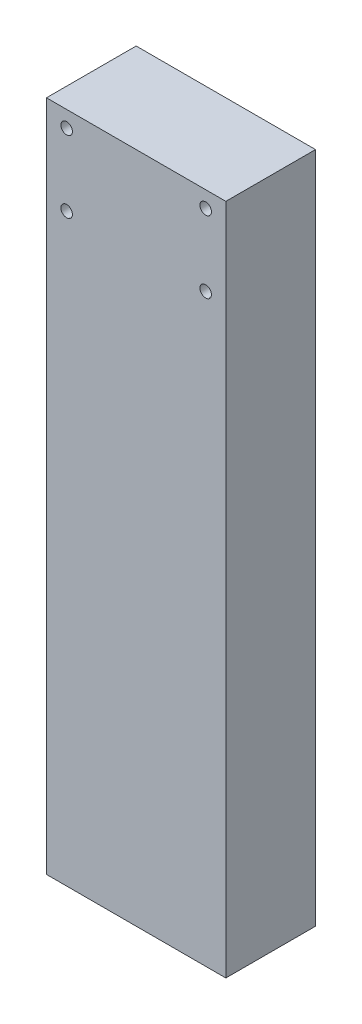
ISO-10303-21;
HEADER;
FILE_DESCRIPTION(('STEP AP214'),'2;1');
FILE_NAME('part.step','',(''),(''),'','','');
FILE_SCHEMA(('AUTOMOTIVE_DESIGN { 1 0 10303 214 1 1 1 1 }'));
ENDSEC;
DATA;
#1=APPLICATION_CONTEXT('core data for automotive mechanical design processes');
#2=APPLICATION_PROTOCOL_DEFINITION('international standard','automotive_design',2000,#1);
#3=PRODUCT_CONTEXT('',#1,'mechanical');
#4=PRODUCT('Part','Part','',(#3));
#5=PRODUCT_RELATED_PRODUCT_CATEGORY('part','',(#4));
#6=PRODUCT_DEFINITION_FORMATION('','',#4);
#7=PRODUCT_DEFINITION_CONTEXT('part definition',#1,'design');
#8=PRODUCT_DEFINITION('design','',#6,#7);
#9=PRODUCT_DEFINITION_SHAPE('','',#8);
#10=(LENGTH_UNIT() NAMED_UNIT(*) SI_UNIT(.MILLI.,.METRE.));
#11=(NAMED_UNIT(*) PLANE_ANGLE_UNIT() SI_UNIT($,.RADIAN.));
#12=(NAMED_UNIT(*) SI_UNIT($,.STERADIAN.) SOLID_ANGLE_UNIT());
#13=UNCERTAINTY_MEASURE_WITH_UNIT(LENGTH_MEASURE(1.E-05),#10,'distance_accuracy_value','');
#14=(GEOMETRIC_REPRESENTATION_CONTEXT(3) GLOBAL_UNCERTAINTY_ASSIGNED_CONTEXT((#13)) GLOBAL_UNIT_ASSIGNED_CONTEXT((#10,
#11,#12)) REPRESENTATION_CONTEXT('',''));
#15=CARTESIAN_POINT('',(0.,0.,0.));
#16=DIRECTION('',(0.,0.,1.));
#17=DIRECTION('',(1.,0.,0.));
#18=AXIS2_PLACEMENT_3D('',#15,#16,#17);
#19=CARTESIAN_POINT('',(50.8,381.,25.4));
#20=DIRECTION('',(-1.,0.,0.));
#21=DIRECTION('',(0.,0.,1.));
#22=AXIS2_PLACEMENT_3D('',#19,#20,#21);
#23=PLANE('',#22);
#24=DIRECTION('',(0.,0.,-1.));
#25=VECTOR('',#24,1.);
#26=CARTESIAN_POINT('',(50.8,0.,25.4));
#27=LINE('',#26,#25);
#28=CARTESIAN_POINT('',(50.8,0.,25.4));
#29=VERTEX_POINT('',#28);
#30=CARTESIAN_POINT('',(50.8,0.,-25.4));
#31=VERTEX_POINT('',#30);
#32=EDGE_CURVE('E96',#29,#31,#27,.T.);
#33=ORIENTED_EDGE('',*,*,#32,.T.);
#34=DIRECTION('',(0.,-1.,0.));
#35=VECTOR('',#34,1.);
#36=CARTESIAN_POINT('',(50.8,381.,-25.4));
#37=LINE('',#36,#35);
#38=CARTESIAN_POINT('',(50.8,381.,-25.4));
#39=VERTEX_POINT('',#38);
#40=EDGE_CURVE('E11',#39,#31,#37,.T.);
#41=ORIENTED_EDGE('',*,*,#40,.F.);
#42=DIRECTION('',(0.,0.,-1.));
#43=VECTOR('',#42,1.);
#44=CARTESIAN_POINT('',(50.8,381.,25.4));
#45=LINE('',#44,#43);
#46=CARTESIAN_POINT('',(50.8,381.,25.4));
#47=VERTEX_POINT('',#46);
#48=EDGE_CURVE('E84',#47,#39,#45,.T.);
#49=ORIENTED_EDGE('',*,*,#48,.F.);
#50=DIRECTION('',(0.,-1.,0.));
#51=VECTOR('',#50,1.);
#52=CARTESIAN_POINT('',(50.8,381.,25.4));
#53=LINE('',#52,#51);
#54=EDGE_CURVE('E92',#47,#29,#53,.T.);
#55=ORIENTED_EDGE('',*,*,#54,.T.);
#56=EDGE_LOOP('',(#33,#41,#49,#55));
#57=FACE_BOUND('',#56,.T.);
#58=ADVANCED_FACE('F33',(#57),#23,.F.);
#59=CARTESIAN_POINT('',(-50.8,381.,-25.4));
#60=DIRECTION('',(0.,0.,1.));
#61=DIRECTION('',(1.,0.,0.));
#62=AXIS2_PLACEMENT_3D('',#59,#60,#61);
#63=PLANE('',#62);
#64=CARTESIAN_POINT('',(39.37,371.76075,-25.4));
#65=DIRECTION('',(0.,0.,1.));
#66=DIRECTION('',(1.,0.,0.));
#67=AXIS2_PLACEMENT_3D('',#64,#65,#66);
#68=CIRCLE('',#67,3.26389999999998);
#69=CARTESIAN_POINT('',(42.6339,371.76075,-25.4));
#70=VERTEX_POINT('',#69);
#71=EDGE_CURVE('E127',#70,#70,#68,.T.);
#72=ORIENTED_EDGE('',*,*,#71,.T.);
#73=EDGE_LOOP('',(#72));
#74=FACE_BOUND('',#73,.T.);
#75=CARTESIAN_POINT('',(39.37,331.12075,-25.4));
#76=DIRECTION('',(0.,0.,1.));
#77=DIRECTION('',(1.,0.,0.));
#78=AXIS2_PLACEMENT_3D('',#75,#76,#77);
#79=CIRCLE('',#78,3.26389999999998);
#80=CARTESIAN_POINT('',(42.6339,331.12075,-25.4));
#81=VERTEX_POINT('',#80);
#82=EDGE_CURVE('E121',#81,#81,#79,.T.);
#83=ORIENTED_EDGE('',*,*,#82,.T.);
#84=EDGE_LOOP('',(#83));
#85=FACE_BOUND('',#84,.T.);
#86=CARTESIAN_POINT('',(-39.37,331.12075,-25.4));
#87=DIRECTION('',(0.,0.,1.));
#88=DIRECTION('',(1.,0.,0.));
#89=AXIS2_PLACEMENT_3D('',#86,#87,#88);
#90=CIRCLE('',#89,3.26389999999998);
#91=CARTESIAN_POINT('',(-36.1061,331.12075,-25.4));
#92=VERTEX_POINT('',#91);
#93=EDGE_CURVE('E115',#92,#92,#90,.T.);
#94=ORIENTED_EDGE('',*,*,#93,.T.);
#95=EDGE_LOOP('',(#94));
#96=FACE_BOUND('',#95,.T.);
#97=CARTESIAN_POINT('',(-39.37,371.76075,-25.4));
#98=DIRECTION('',(0.,0.,1.));
#99=DIRECTION('',(1.,0.,0.));
#100=AXIS2_PLACEMENT_3D('',#97,#98,#99);
#101=CIRCLE('',#100,3.26389999999998);
#102=CARTESIAN_POINT('',(-36.1061,371.76075,-25.4));
#103=VERTEX_POINT('',#102);
#104=EDGE_CURVE('E99',#103,#103,#101,.T.);
#105=ORIENTED_EDGE('',*,*,#104,.T.);
#106=EDGE_LOOP('',(#105));
#107=FACE_BOUND('',#106,.T.);
#108=DIRECTION('',(-1.,0.,0.));
#109=VECTOR('',#108,1.);
#110=CARTESIAN_POINT('',(-50.8,0.,-25.4));
#111=LINE('',#110,#109);
#112=CARTESIAN_POINT('',(-50.8,0.,-25.4));
#113=VERTEX_POINT('',#112);
#114=EDGE_CURVE('E88',#31,#113,#111,.T.);
#115=ORIENTED_EDGE('',*,*,#114,.T.);
#116=DIRECTION('',(0.,-1.,0.));
#117=VECTOR('',#116,1.);
#118=CARTESIAN_POINT('',(-50.8,381.,-25.4));
#119=LINE('',#118,#117);
#120=CARTESIAN_POINT('',(-50.8,381.,-25.4));
#121=VERTEX_POINT('',#120);
#122=EDGE_CURVE('E41',#121,#113,#119,.T.);
#123=ORIENTED_EDGE('',*,*,#122,.F.);
#124=DIRECTION('',(-1.,0.,0.));
#125=VECTOR('',#124,1.);
#126=CARTESIAN_POINT('',(-50.8,381.,-25.4));
#127=LINE('',#126,#125);
#128=EDGE_CURVE('E79',#39,#121,#127,.T.);
#129=ORIENTED_EDGE('',*,*,#128,.F.);
#130=ORIENTED_EDGE('',*,*,#40,.T.);
#131=EDGE_LOOP('',(#115,#123,#129,#130));
#132=FACE_BOUND('',#131,.T.);
#133=ADVANCED_FACE('F87',(#74,#85,#96,#107,#132),#63,.F.);
#134=CARTESIAN_POINT('',(-50.8,381.,25.4));
#135=DIRECTION('',(1.,0.,0.));
#136=DIRECTION('',(0.,0.,-1.));
#137=AXIS2_PLACEMENT_3D('',#134,#135,#136);
#138=PLANE('',#137);
#139=DIRECTION('',(0.,0.,1.));
#140=VECTOR('',#139,1.);
#141=CARTESIAN_POINT('',(-50.8,0.,25.4));
#142=LINE('',#141,#140);
#143=CARTESIAN_POINT('',(-50.8,0.,25.4));
#144=VERTEX_POINT('',#143);
#145=EDGE_CURVE('E66',#113,#144,#142,.T.);
#146=ORIENTED_EDGE('',*,*,#145,.T.);
#147=DIRECTION('',(0.,-1.,0.));
#148=VECTOR('',#147,1.);
#149=CARTESIAN_POINT('',(-50.8,381.,25.4));
#150=LINE('',#149,#148);
#151=CARTESIAN_POINT('',(-50.8,381.,25.4));
#152=VERTEX_POINT('',#151);
#153=EDGE_CURVE('E89',#152,#144,#150,.T.);
#154=ORIENTED_EDGE('',*,*,#153,.F.);
#155=DIRECTION('',(0.,0.,1.));
#156=VECTOR('',#155,1.);
#157=CARTESIAN_POINT('',(-50.8,381.,25.4));
#158=LINE('',#157,#156);
#159=EDGE_CURVE('E82',#121,#152,#158,.T.);
#160=ORIENTED_EDGE('',*,*,#159,.F.);
#161=ORIENTED_EDGE('',*,*,#122,.T.);
#162=EDGE_LOOP('',(#146,#154,#160,#161));
#163=FACE_BOUND('',#162,.T.);
#164=ADVANCED_FACE('F90',(#163),#138,.F.);
#165=CARTESIAN_POINT('',(-50.8,381.,25.4));
#166=DIRECTION('',(0.,0.,-1.));
#167=DIRECTION('',(-1.,0.,0.));
#168=AXIS2_PLACEMENT_3D('',#165,#166,#167);
#169=PLANE('',#168);
#170=CARTESIAN_POINT('',(39.37,371.76075,25.4000000000001));
#171=DIRECTION('',(0.,0.,1.));
#172=DIRECTION('',(1.,0.,0.));
#173=AXIS2_PLACEMENT_3D('',#170,#171,#172);
#174=CIRCLE('',#173,3.26389999999999);
#175=CARTESIAN_POINT('',(42.6339,371.76075,25.4000000000001));
#176=VERTEX_POINT('',#175);
#177=EDGE_CURVE('E130',#176,#176,#174,.T.);
#178=ORIENTED_EDGE('',*,*,#177,.F.);
#179=EDGE_LOOP('',(#178));
#180=FACE_BOUND('',#179,.T.);
#181=CARTESIAN_POINT('',(39.37,331.12075,25.4000000000001));
#182=DIRECTION('',(0.,0.,1.));
#183=DIRECTION('',(1.,0.,0.));
#184=AXIS2_PLACEMENT_3D('',#181,#182,#183);
#185=CIRCLE('',#184,3.26389999999999);
#186=CARTESIAN_POINT('',(42.6339,331.12075,25.4000000000001));
#187=VERTEX_POINT('',#186);
#188=EDGE_CURVE('E124',#187,#187,#185,.T.);
#189=ORIENTED_EDGE('',*,*,#188,.F.);
#190=EDGE_LOOP('',(#189));
#191=FACE_BOUND('',#190,.T.);
#192=CARTESIAN_POINT('',(-39.37,331.12075,25.4000000000001));
#193=DIRECTION('',(0.,0.,1.));
#194=DIRECTION('',(1.,0.,0.));
#195=AXIS2_PLACEMENT_3D('',#192,#193,#194);
#196=CIRCLE('',#195,3.26389999999999);
#197=CARTESIAN_POINT('',(-36.1061,331.12075,25.4000000000001));
#198=VERTEX_POINT('',#197);
#199=EDGE_CURVE('E118',#198,#198,#196,.T.);
#200=ORIENTED_EDGE('',*,*,#199,.F.);
#201=EDGE_LOOP('',(#200));
#202=FACE_BOUND('',#201,.T.);
#203=CARTESIAN_POINT('',(-39.37,371.76075,25.4000000000001));
#204=DIRECTION('',(0.,0.,1.));
#205=DIRECTION('',(1.,0.,0.));
#206=AXIS2_PLACEMENT_3D('',#203,#204,#205);
#207=CIRCLE('',#206,3.26389999999999);
#208=CARTESIAN_POINT('',(-36.1061,371.76075,25.4000000000001));
#209=VERTEX_POINT('',#208);
#210=EDGE_CURVE('E112',#209,#209,#207,.T.);
#211=ORIENTED_EDGE('',*,*,#210,.F.);
#212=EDGE_LOOP('',(#211));
#213=FACE_BOUND('',#212,.T.);
#214=DIRECTION('',(1.,0.,0.));
#215=VECTOR('',#214,1.);
#216=CARTESIAN_POINT('',(-50.8,0.,25.4));
#217=LINE('',#216,#215);
#218=EDGE_CURVE('E72',#144,#29,#217,.T.);
#219=ORIENTED_EDGE('',*,*,#218,.T.);
#220=ORIENTED_EDGE('',*,*,#54,.F.);
#221=DIRECTION('',(1.,0.,0.));
#222=VECTOR('',#221,1.);
#223=CARTESIAN_POINT('',(-50.8,381.,25.4));
#224=LINE('',#223,#222);
#225=EDGE_CURVE('E49',#152,#47,#224,.T.);
#226=ORIENTED_EDGE('',*,*,#225,.F.);
#227=ORIENTED_EDGE('',*,*,#153,.T.);
#228=EDGE_LOOP('',(#219,#220,#226,#227));
#229=FACE_BOUND('',#228,.T.);
#230=ADVANCED_FACE('F104',(#180,#191,#202,#213,#229),#169,.F.);
#231=CARTESIAN_POINT('',(0.,381.,0.));
#232=DIRECTION('',(0.,-1.,0.));
#233=DIRECTION('',(0.,0.,-1.));
#234=AXIS2_PLACEMENT_3D('',#231,#232,#233);
#235=PLANE('',#234);
#236=ORIENTED_EDGE('',*,*,#48,.T.);
#237=ORIENTED_EDGE('',*,*,#128,.T.);
#238=ORIENTED_EDGE('',*,*,#159,.T.);
#239=ORIENTED_EDGE('',*,*,#225,.T.);
#240=EDGE_LOOP('',(#236,#237,#238,#239));
#241=FACE_BOUND('',#240,.T.);
#242=ADVANCED_FACE('F80',(#241),#235,.F.);
#243=CARTESIAN_POINT('',(0.,0.,0.));
#244=DIRECTION('',(0.,-1.,0.));
#245=DIRECTION('',(0.,0.,-1.));
#246=AXIS2_PLACEMENT_3D('',#243,#244,#245);
#247=PLANE('',#246);
#248=ORIENTED_EDGE('',*,*,#32,.F.);
#249=ORIENTED_EDGE('',*,*,#218,.F.);
#250=ORIENTED_EDGE('',*,*,#145,.F.);
#251=ORIENTED_EDGE('',*,*,#114,.F.);
#252=EDGE_LOOP('',(#248,#249,#250,#251));
#253=FACE_BOUND('',#252,.T.);
#254=ADVANCED_FACE('F107',(#253),#247,.T.);
#255=CARTESIAN_POINT('',(-39.37,371.76075,25.4000000000001));
#256=DIRECTION('',(0.,0.,1.));
#257=DIRECTION('',(1.,0.,0.));
#258=AXIS2_PLACEMENT_3D('',#255,#256,#257);
#259=CYLINDRICAL_SURFACE('',#258,3.26389999999998);
#260=ORIENTED_EDGE('',*,*,#104,.F.);
#261=EDGE_LOOP('',(#260));
#262=FACE_BOUND('',#261,.T.);
#263=ORIENTED_EDGE('',*,*,#210,.T.);
#264=EDGE_LOOP('',(#263));
#265=FACE_BOUND('',#264,.T.);
#266=ADVANCED_FACE('F145',(#262,#265),#259,.F.);
#267=CARTESIAN_POINT('',(-39.37,331.12075,25.4000000000001));
#268=DIRECTION('',(0.,0.,1.));
#269=DIRECTION('',(1.,0.,0.));
#270=AXIS2_PLACEMENT_3D('',#267,#268,#269);
#271=CYLINDRICAL_SURFACE('',#270,3.26389999999998);
#272=ORIENTED_EDGE('',*,*,#93,.F.);
#273=EDGE_LOOP('',(#272));
#274=FACE_BOUND('',#273,.T.);
#275=ORIENTED_EDGE('',*,*,#199,.T.);
#276=EDGE_LOOP('',(#275));
#277=FACE_BOUND('',#276,.T.);
#278=ADVANCED_FACE('F147',(#274,#277),#271,.F.);
#279=CARTESIAN_POINT('',(39.37,331.12075,25.4000000000001));
#280=DIRECTION('',(0.,0.,1.));
#281=DIRECTION('',(1.,0.,0.));
#282=AXIS2_PLACEMENT_3D('',#279,#280,#281);
#283=CYLINDRICAL_SURFACE('',#282,3.26389999999998);
#284=ORIENTED_EDGE('',*,*,#82,.F.);
#285=EDGE_LOOP('',(#284));
#286=FACE_BOUND('',#285,.T.);
#287=ORIENTED_EDGE('',*,*,#188,.T.);
#288=EDGE_LOOP('',(#287));
#289=FACE_BOUND('',#288,.T.);
#290=ADVANCED_FACE('F154',(#286,#289),#283,.F.);
#291=CARTESIAN_POINT('',(39.37,371.76075,25.4000000000001));
#292=DIRECTION('',(0.,0.,1.));
#293=DIRECTION('',(1.,0.,0.));
#294=AXIS2_PLACEMENT_3D('',#291,#292,#293);
#295=CYLINDRICAL_SURFACE('',#294,3.26389999999998);
#296=ORIENTED_EDGE('',*,*,#71,.F.);
#297=EDGE_LOOP('',(#296));
#298=FACE_BOUND('',#297,.T.);
#299=ORIENTED_EDGE('',*,*,#177,.T.);
#300=EDGE_LOOP('',(#299));
#301=FACE_BOUND('',#300,.T.);
#302=ADVANCED_FACE('F134',(#298,#301),#295,.F.);
#303=CLOSED_SHELL('',(#58,#133,#164,#230,#242,#254,#266,#278,#290,#302));
#304=MANIFOLD_SOLID_BREP('B2',#303);
#305=ADVANCED_BREP_SHAPE_REPRESENTATION('',(#18,#304),#14);
#306=SHAPE_DEFINITION_REPRESENTATION(#9,#305);
ENDSEC;
END-ISO-10303-21;
